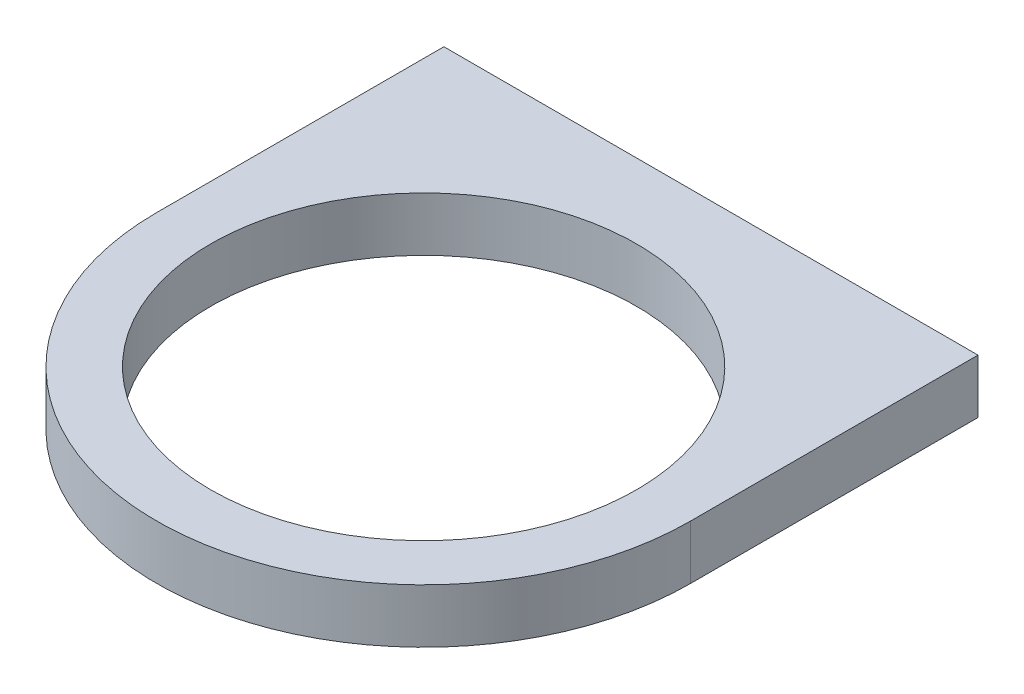
ISO-10303-21;
HEADER;
FILE_DESCRIPTION(('STEP AP214'),'2;1');
FILE_NAME('part.step','',(''),(''),'','','');
FILE_SCHEMA(('AUTOMOTIVE_DESIGN { 1 0 10303 214 1 1 1 1 }'));
ENDSEC;
DATA;
#1=APPLICATION_CONTEXT('core data for automotive mechanical design processes');
#2=APPLICATION_PROTOCOL_DEFINITION('international standard','automotive_design',2000,#1);
#3=PRODUCT_CONTEXT('',#1,'mechanical');
#4=PRODUCT('Part','Part','',(#3));
#5=PRODUCT_RELATED_PRODUCT_CATEGORY('part','',(#4));
#6=PRODUCT_DEFINITION_FORMATION('','',#4);
#7=PRODUCT_DEFINITION_CONTEXT('part definition',#1,'design');
#8=PRODUCT_DEFINITION('design','',#6,#7);
#9=PRODUCT_DEFINITION_SHAPE('','',#8);
#10=(LENGTH_UNIT() NAMED_UNIT(*) SI_UNIT(.MILLI.,.METRE.));
#11=(NAMED_UNIT(*) PLANE_ANGLE_UNIT() SI_UNIT($,.RADIAN.));
#12=(NAMED_UNIT(*) SI_UNIT($,.STERADIAN.) SOLID_ANGLE_UNIT());
#13=UNCERTAINTY_MEASURE_WITH_UNIT(LENGTH_MEASURE(1.E-05),#10,'distance_accuracy_value','');
#14=(GEOMETRIC_REPRESENTATION_CONTEXT(3) GLOBAL_UNCERTAINTY_ASSIGNED_CONTEXT((#13)) GLOBAL_UNIT_ASSIGNED_CONTEXT((#10,
#11,#12)) REPRESENTATION_CONTEXT('',''));
#15=CARTESIAN_POINT('',(0.,0.,0.));
#16=DIRECTION('',(0.,0.,1.));
#17=DIRECTION('',(1.,0.,0.));
#18=AXIS2_PLACEMENT_3D('',#15,#16,#17);
#19=CARTESIAN_POINT('',(0.,0.,0.));
#20=DIRECTION('',(0.,1.,0.));
#21=DIRECTION('',(0.,0.,1.));
#22=AXIS2_PLACEMENT_3D('',#19,#20,#21);
#23=PLANE('',#22);
#24=CARTESIAN_POINT('',(-35.5,0.,-38.5));
#25=DIRECTION('',(0.,1.,0.));
#26=DIRECTION('',(0.,0.,1.));
#27=AXIS2_PLACEMENT_3D('',#24,#25,#26);
#28=CIRCLE('',#27,2.);
#29=CARTESIAN_POINT('',(-35.5,0.,-36.5));
#30=VERTEX_POINT('',#29);
#31=EDGE_CURVE('E42',#30,#30,#28,.F.);
#32=ORIENTED_EDGE('',*,*,#31,.F.);
#33=EDGE_LOOP('',(#32));
#34=FACE_BOUND('',#33,.T.);
#35=CARTESIAN_POINT('',(0.,0.,0.));
#36=DIRECTION('',(0.,1.,0.));
#37=DIRECTION('',(0.,0.,1.));
#38=AXIS2_PLACEMENT_3D('',#35,#36,#37);
#39=CIRCLE('',#38,39.5);
#40=CARTESIAN_POINT('',(-39.5,0.,0.));
#41=VERTEX_POINT('',#40);
#42=CARTESIAN_POINT('',(39.5,0.,0.));
#43=VERTEX_POINT('',#42);
#44=EDGE_CURVE('E102',#41,#43,#39,.T.);
#45=ORIENTED_EDGE('',*,*,#44,.F.);
#46=DIRECTION('',(0.,0.,1.));
#47=VECTOR('',#46,1.);
#48=CARTESIAN_POINT('',(-39.5,0.,0.));
#49=LINE('',#48,#47);
#50=CARTESIAN_POINT('',(-39.5,0.,-42.5));
#51=VERTEX_POINT('',#50);
#52=EDGE_CURVE('E73',#51,#41,#49,.T.);
#53=ORIENTED_EDGE('',*,*,#52,.F.);
#54=DIRECTION('',(-1.,0.,0.));
#55=VECTOR('',#54,1.);
#56=CARTESIAN_POINT('',(-39.5,0.,-42.5));
#57=LINE('',#56,#55);
#58=CARTESIAN_POINT('',(39.5,0.,-42.5));
#59=VERTEX_POINT('',#58);
#60=EDGE_CURVE('E67',#59,#51,#57,.T.);
#61=ORIENTED_EDGE('',*,*,#60,.F.);
#62=DIRECTION('',(0.,0.,-1.));
#63=VECTOR('',#62,1.);
#64=CARTESIAN_POINT('',(39.5,0.,-42.5));
#65=LINE('',#64,#63);
#66=EDGE_CURVE('E92',#43,#59,#65,.T.);
#67=ORIENTED_EDGE('',*,*,#66,.F.);
#68=EDGE_LOOP('',(#45,#53,#61,#67));
#69=FACE_BOUND('',#68,.T.);
#70=CARTESIAN_POINT('',(0.,0.,0.));
#71=DIRECTION('',(0.,1.,0.));
#72=DIRECTION('',(0.,0.,1.));
#73=AXIS2_PLACEMENT_3D('',#70,#71,#72);
#74=CIRCLE('',#73,31.5);
#75=CARTESIAN_POINT('',(0.,0.,31.5));
#76=VERTEX_POINT('',#75);
#77=EDGE_CURVE('E124',#76,#76,#74,.T.);
#78=ORIENTED_EDGE('',*,*,#77,.T.);
#79=EDGE_LOOP('',(#78));
#80=FACE_BOUND('',#79,.T.);
#81=CARTESIAN_POINT('',(35.5,0.,-38.5));
#82=DIRECTION('',(0.,1.,0.));
#83=DIRECTION('',(0.,0.,1.));
#84=AXIS2_PLACEMENT_3D('',#81,#82,#83);
#85=CIRCLE('',#84,2.);
#86=CARTESIAN_POINT('',(35.5,0.,-36.5));
#87=VERTEX_POINT('',#86);
#88=EDGE_CURVE('E11',#87,#87,#85,.F.);
#89=ORIENTED_EDGE('',*,*,#88,.F.);
#90=EDGE_LOOP('',(#89));
#91=FACE_BOUND('',#90,.T.);
#92=ADVANCED_FACE('F33',(#34,#69,#80,#91),#23,.F.);
#93=CARTESIAN_POINT('',(0.,8.,0.));
#94=DIRECTION('',(0.,1.,0.));
#95=DIRECTION('',(0.,0.,1.));
#96=AXIS2_PLACEMENT_3D('',#93,#94,#95);
#97=PLANE('',#96);
#98=CARTESIAN_POINT('',(0.,8.,0.));
#99=DIRECTION('',(0.,1.,0.));
#100=DIRECTION('',(0.,0.,1.));
#101=AXIS2_PLACEMENT_3D('',#98,#99,#100);
#102=CIRCLE('',#101,39.5);
#103=CARTESIAN_POINT('',(-39.5,8.,0.));
#104=VERTEX_POINT('',#103);
#105=CARTESIAN_POINT('',(39.5,8.,0.));
#106=VERTEX_POINT('',#105);
#107=EDGE_CURVE('E87',#104,#106,#102,.T.);
#108=ORIENTED_EDGE('',*,*,#107,.T.);
#109=DIRECTION('',(0.,0.,-1.));
#110=VECTOR('',#109,1.);
#111=CARTESIAN_POINT('',(39.5,8.,-42.5));
#112=LINE('',#111,#110);
#113=CARTESIAN_POINT('',(39.5,8.,-42.5));
#114=VERTEX_POINT('',#113);
#115=EDGE_CURVE('E81',#106,#114,#112,.T.);
#116=ORIENTED_EDGE('',*,*,#115,.T.);
#117=DIRECTION('',(-1.,0.,0.));
#118=VECTOR('',#117,1.);
#119=CARTESIAN_POINT('',(-39.5,8.,-42.5));
#120=LINE('',#119,#118);
#121=CARTESIAN_POINT('',(-39.5,8.,-42.5));
#122=VERTEX_POINT('',#121);
#123=EDGE_CURVE('E85',#114,#122,#120,.T.);
#124=ORIENTED_EDGE('',*,*,#123,.T.);
#125=DIRECTION('',(0.,0.,1.));
#126=VECTOR('',#125,1.);
#127=CARTESIAN_POINT('',(-39.5,8.,0.));
#128=LINE('',#127,#126);
#129=EDGE_CURVE('E50',#122,#104,#128,.T.);
#130=ORIENTED_EDGE('',*,*,#129,.T.);
#131=EDGE_LOOP('',(#108,#116,#124,#130));
#132=FACE_BOUND('',#131,.T.);
#133=CARTESIAN_POINT('',(0.,8.,0.));
#134=DIRECTION('',(0.,1.,0.));
#135=DIRECTION('',(0.,0.,1.));
#136=AXIS2_PLACEMENT_3D('',#133,#134,#135);
#137=CIRCLE('',#136,31.5);
#138=CARTESIAN_POINT('',(0.,8.,31.5));
#139=VERTEX_POINT('',#138);
#140=EDGE_CURVE('E105',#139,#139,#137,.T.);
#141=ORIENTED_EDGE('',*,*,#140,.F.);
#142=EDGE_LOOP('',(#141));
#143=FACE_BOUND('',#142,.T.);
#144=ADVANCED_FACE('F82',(#132,#143),#97,.T.);
#145=CARTESIAN_POINT('',(0.,8.,0.));
#146=DIRECTION('',(0.,-1.,0.));
#147=DIRECTION('',(0.,0.,-1.));
#148=AXIS2_PLACEMENT_3D('',#145,#146,#147);
#149=CYLINDRICAL_SURFACE('',#148,39.5);
#150=ORIENTED_EDGE('',*,*,#44,.T.);
#151=DIRECTION('',(0.,-1.,0.));
#152=VECTOR('',#151,1.);
#153=CARTESIAN_POINT('',(39.5,8.,0.));
#154=LINE('',#153,#152);
#155=EDGE_CURVE('E93',#106,#43,#154,.T.);
#156=ORIENTED_EDGE('',*,*,#155,.F.);
#157=ORIENTED_EDGE('',*,*,#107,.F.);
#158=DIRECTION('',(0.,-1.,0.));
#159=VECTOR('',#158,1.);
#160=CARTESIAN_POINT('',(-39.5,8.,0.));
#161=LINE('',#160,#159);
#162=EDGE_CURVE('E98',#104,#41,#161,.T.);
#163=ORIENTED_EDGE('',*,*,#162,.T.);
#164=EDGE_LOOP('',(#150,#156,#157,#163));
#165=FACE_BOUND('',#164,.T.);
#166=ADVANCED_FACE('F35',(#165),#149,.T.);
#167=CARTESIAN_POINT('',(39.5,8.,-42.5));
#168=DIRECTION('',(-1.,0.,0.));
#169=DIRECTION('',(0.,0.,1.));
#170=AXIS2_PLACEMENT_3D('',#167,#168,#169);
#171=PLANE('',#170);
#172=ORIENTED_EDGE('',*,*,#66,.T.);
#173=DIRECTION('',(0.,-1.,0.));
#174=VECTOR('',#173,1.);
#175=CARTESIAN_POINT('',(39.5,8.,-42.5));
#176=LINE('',#175,#174);
#177=EDGE_CURVE('E90',#114,#59,#176,.T.);
#178=ORIENTED_EDGE('',*,*,#177,.F.);
#179=ORIENTED_EDGE('',*,*,#115,.F.);
#180=ORIENTED_EDGE('',*,*,#155,.T.);
#181=EDGE_LOOP('',(#172,#178,#179,#180));
#182=FACE_BOUND('',#181,.T.);
#183=ADVANCED_FACE('F91',(#182),#171,.F.);
#184=CARTESIAN_POINT('',(-39.5,8.,-42.5));
#185=DIRECTION('',(0.,0.,1.));
#186=DIRECTION('',(1.,0.,0.));
#187=AXIS2_PLACEMENT_3D('',#184,#185,#186);
#188=PLANE('',#187);
#189=ORIENTED_EDGE('',*,*,#60,.T.);
#190=DIRECTION('',(0.,-1.,0.));
#191=VECTOR('',#190,1.);
#192=CARTESIAN_POINT('',(-39.5,8.,-42.5));
#193=LINE('',#192,#191);
#194=EDGE_CURVE('E94',#122,#51,#193,.T.);
#195=ORIENTED_EDGE('',*,*,#194,.F.);
#196=ORIENTED_EDGE('',*,*,#123,.F.);
#197=ORIENTED_EDGE('',*,*,#177,.T.);
#198=EDGE_LOOP('',(#189,#195,#196,#197));
#199=FACE_BOUND('',#198,.T.);
#200=ADVANCED_FACE('F96',(#199),#188,.F.);
#201=CARTESIAN_POINT('',(-39.5,8.,0.));
#202=DIRECTION('',(1.,0.,0.));
#203=DIRECTION('',(0.,0.,-1.));
#204=AXIS2_PLACEMENT_3D('',#201,#202,#203);
#205=PLANE('',#204);
#206=ORIENTED_EDGE('',*,*,#52,.T.);
#207=ORIENTED_EDGE('',*,*,#162,.F.);
#208=ORIENTED_EDGE('',*,*,#129,.F.);
#209=ORIENTED_EDGE('',*,*,#194,.T.);
#210=EDGE_LOOP('',(#206,#207,#208,#209));
#211=FACE_BOUND('',#210,.T.);
#212=ADVANCED_FACE('F149',(#211),#205,.F.);
#213=CARTESIAN_POINT('',(0.,8.,0.));
#214=DIRECTION('',(0.,-1.,0.));
#215=DIRECTION('',(0.,0.,-1.));
#216=AXIS2_PLACEMENT_3D('',#213,#214,#215);
#217=CYLINDRICAL_SURFACE('',#216,31.5);
#218=ORIENTED_EDGE('',*,*,#140,.T.);
#219=EDGE_LOOP('',(#218));
#220=FACE_BOUND('',#219,.T.);
#221=ORIENTED_EDGE('',*,*,#77,.F.);
#222=EDGE_LOOP('',(#221));
#223=FACE_BOUND('',#222,.T.);
#224=ADVANCED_FACE('F145',(#220,#223),#217,.F.);
#225=CARTESIAN_POINT('',(-35.5,-2.,-38.5));
#226=DIRECTION('',(0.,1.,0.));
#227=DIRECTION('',(0.,0.,1.));
#228=AXIS2_PLACEMENT_3D('',#225,#226,#227);
#229=CYLINDRICAL_SURFACE('',#228,2.);
#230=CARTESIAN_POINT('',(-35.5,-2.,-38.5));
#231=DIRECTION('',(0.,-1.,0.));
#232=DIRECTION('',(0.,0.,-1.));
#233=AXIS2_PLACEMENT_3D('',#230,#231,#232);
#234=CIRCLE('',#233,2.);
#235=CARTESIAN_POINT('',(-35.5,-2.,-40.5));
#236=VERTEX_POINT('',#235);
#237=EDGE_CURVE('E165',#236,#236,#234,.T.);
#238=ORIENTED_EDGE('',*,*,#237,.F.);
#239=EDGE_LOOP('',(#238));
#240=FACE_BOUND('',#239,.T.);
#241=ORIENTED_EDGE('',*,*,#31,.T.);
#242=EDGE_LOOP('',(#241));
#243=FACE_BOUND('',#242,.T.);
#244=ADVANCED_FACE('F114',(#240,#243),#229,.T.);
#245=CARTESIAN_POINT('',(-35.5,-2.,-38.5));
#246=DIRECTION('',(0.,-1.,0.));
#247=DIRECTION('',(0.,0.,-1.));
#248=AXIS2_PLACEMENT_3D('',#245,#246,#247);
#249=PLANE('',#248);
#250=ORIENTED_EDGE('',*,*,#237,.T.);
#251=EDGE_LOOP('',(#250));
#252=FACE_BOUND('',#251,.T.);
#253=ADVANCED_FACE('F130',(#252),#249,.T.);
#254=CARTESIAN_POINT('',(35.5,-2.,-38.5));
#255=DIRECTION('',(0.,1.,0.));
#256=DIRECTION('',(0.,0.,1.));
#257=AXIS2_PLACEMENT_3D('',#254,#255,#256);
#258=CYLINDRICAL_SURFACE('',#257,2.);
#259=CARTESIAN_POINT('',(35.5,-2.,-38.5));
#260=DIRECTION('',(0.,-1.,0.));
#261=DIRECTION('',(0.,0.,-1.));
#262=AXIS2_PLACEMENT_3D('',#259,#260,#261);
#263=CIRCLE('',#262,2.);
#264=CARTESIAN_POINT('',(35.5,-2.,-40.5));
#265=VERTEX_POINT('',#264);
#266=EDGE_CURVE('E170',#265,#265,#263,.T.);
#267=ORIENTED_EDGE('',*,*,#266,.F.);
#268=EDGE_LOOP('',(#267));
#269=FACE_BOUND('',#268,.T.);
#270=ORIENTED_EDGE('',*,*,#88,.T.);
#271=EDGE_LOOP('',(#270));
#272=FACE_BOUND('',#271,.T.);
#273=ADVANCED_FACE('F127',(#269,#272),#258,.T.);
#274=CARTESIAN_POINT('',(35.5,-2.,-38.5));
#275=DIRECTION('',(0.,-1.,0.));
#276=DIRECTION('',(0.,0.,-1.));
#277=AXIS2_PLACEMENT_3D('',#274,#275,#276);
#278=PLANE('',#277);
#279=ORIENTED_EDGE('',*,*,#266,.T.);
#280=EDGE_LOOP('',(#279));
#281=FACE_BOUND('',#280,.T.);
#282=ADVANCED_FACE('F129',(#281),#278,.T.);
#283=CLOSED_SHELL('',(#92,#144,#166,#183,#200,#212,#224,#244,#253,#273,#282));
#284=MANIFOLD_SOLID_BREP('B2',#283);
#285=ADVANCED_BREP_SHAPE_REPRESENTATION('',(#18,#284),#14);
#286=SHAPE_DEFINITION_REPRESENTATION(#9,#285);
ENDSEC;
END-ISO-10303-21;
